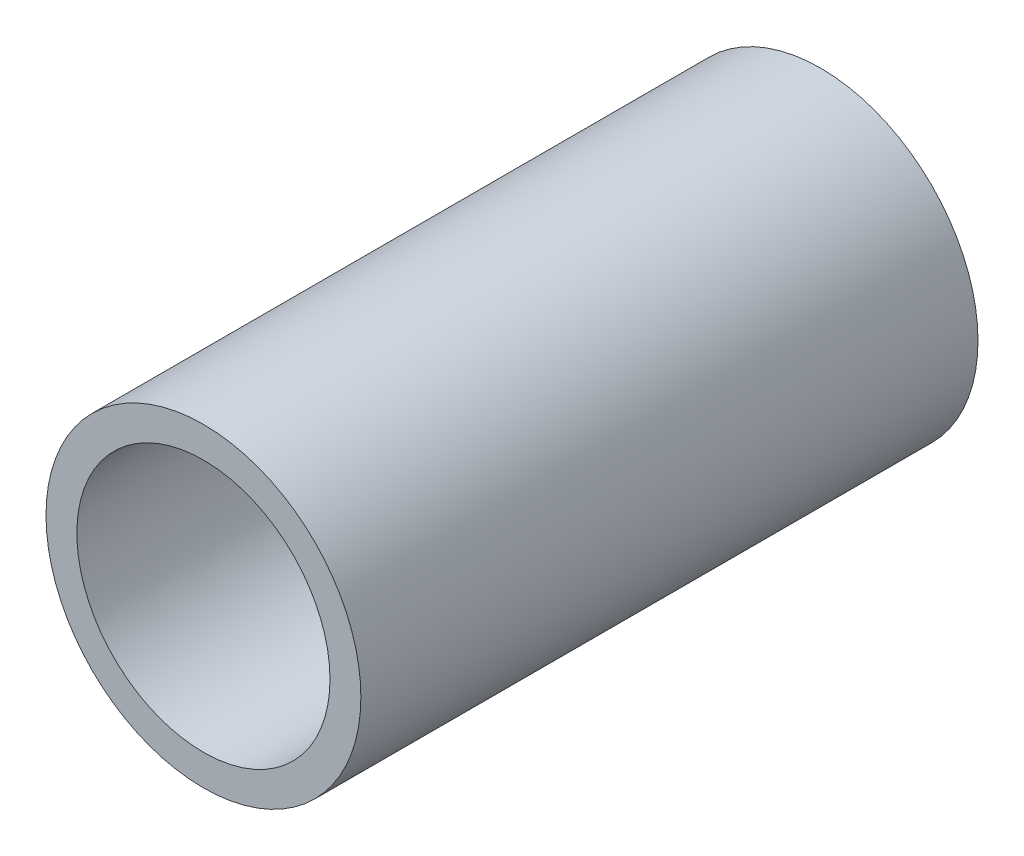
ISO-10303-21;
HEADER;
FILE_DESCRIPTION(('STEP AP214'),'2;1');
FILE_NAME('part.step','',(''),(''),'','','');
FILE_SCHEMA(('AUTOMOTIVE_DESIGN { 1 0 10303 214 1 1 1 1 }'));
ENDSEC;
DATA;
#1=APPLICATION_CONTEXT('core data for automotive mechanical design processes');
#2=APPLICATION_PROTOCOL_DEFINITION('international standard','automotive_design',2000,#1);
#3=PRODUCT_CONTEXT('',#1,'mechanical');
#4=PRODUCT('Part','Part','',(#3));
#5=PRODUCT_RELATED_PRODUCT_CATEGORY('part','',(#4));
#6=PRODUCT_DEFINITION_FORMATION('','',#4);
#7=PRODUCT_DEFINITION_CONTEXT('part definition',#1,'design');
#8=PRODUCT_DEFINITION('design','',#6,#7);
#9=PRODUCT_DEFINITION_SHAPE('','',#8);
#10=(LENGTH_UNIT() NAMED_UNIT(*) SI_UNIT(.MILLI.,.METRE.));
#11=(NAMED_UNIT(*) PLANE_ANGLE_UNIT() SI_UNIT($,.RADIAN.));
#12=(NAMED_UNIT(*) SI_UNIT($,.STERADIAN.) SOLID_ANGLE_UNIT());
#13=UNCERTAINTY_MEASURE_WITH_UNIT(LENGTH_MEASURE(1.E-05),#10,'distance_accuracy_value','');
#14=(GEOMETRIC_REPRESENTATION_CONTEXT(3) GLOBAL_UNCERTAINTY_ASSIGNED_CONTEXT((#13)) GLOBAL_UNIT_ASSIGNED_CONTEXT((#10,
#11,#12)) REPRESENTATION_CONTEXT('',''));
#15=CARTESIAN_POINT('',(0.,0.,0.));
#16=DIRECTION('',(0.,0.,1.));
#17=DIRECTION('',(1.,0.,0.));
#18=AXIS2_PLACEMENT_3D('',#15,#16,#17);
#19=CARTESIAN_POINT('',(0.,0.,12.446));
#20=DIRECTION('',(0.,0.,1.));
#21=DIRECTION('',(1.,0.,0.));
#22=AXIS2_PLACEMENT_3D('',#19,#20,#21);
#23=PLANE('',#22);
#24=CARTESIAN_POINT('',(0.,0.,12.446));
#25=DIRECTION('',(0.,0.,1.));
#26=DIRECTION('',(1.,0.,0.));
#27=AXIS2_PLACEMENT_3D('',#24,#25,#26);
#28=CIRCLE('',#27,6.35);
#29=CARTESIAN_POINT('',(6.35,0.,12.446));
#30=VERTEX_POINT('',#29);
#31=EDGE_CURVE('E10',#30,#30,#28,.T.);
#32=ORIENTED_EDGE('',*,*,#31,.T.);
#33=EDGE_LOOP('',(#32));
#34=FACE_BOUND('',#33,.T.);
#35=CARTESIAN_POINT('',(0.,0.,12.446));
#36=DIRECTION('',(0.,0.,1.));
#37=DIRECTION('',(1.,0.,0.));
#38=AXIS2_PLACEMENT_3D('',#35,#36,#37);
#39=CIRCLE('',#38,5.1054);
#40=CARTESIAN_POINT('',(5.1054,0.,12.446));
#41=VERTEX_POINT('',#40);
#42=EDGE_CURVE('E42',#41,#41,#39,.T.);
#43=ORIENTED_EDGE('',*,*,#42,.F.);
#44=EDGE_LOOP('',(#43));
#45=FACE_BOUND('',#44,.T.);
#46=ADVANCED_FACE('F35',(#34,#45),#23,.T.);
#47=CARTESIAN_POINT('',(0.,0.,12.446));
#48=DIRECTION('',(0.,0.,-1.));
#49=DIRECTION('',(-1.,0.,0.));
#50=AXIS2_PLACEMENT_3D('',#47,#48,#49);
#51=CYLINDRICAL_SURFACE('',#50,6.35);
#52=ORIENTED_EDGE('',*,*,#31,.F.);
#53=EDGE_LOOP('',(#52));
#54=FACE_BOUND('',#53,.T.);
#55=CARTESIAN_POINT('',(0.,0.,-12.446));
#56=DIRECTION('',(0.,0.,1.));
#57=DIRECTION('',(1.,0.,0.));
#58=AXIS2_PLACEMENT_3D('',#55,#56,#57);
#59=CIRCLE('',#58,6.35);
#60=CARTESIAN_POINT('',(6.35,0.,-12.446));
#61=VERTEX_POINT('',#60);
#62=EDGE_CURVE('E46',#61,#61,#59,.T.);
#63=ORIENTED_EDGE('',*,*,#62,.T.);
#64=EDGE_LOOP('',(#63));
#65=FACE_BOUND('',#64,.T.);
#66=ADVANCED_FACE('F37',(#54,#65),#51,.T.);
#67=CARTESIAN_POINT('',(0.,0.,12.446));
#68=DIRECTION('',(0.,0.,-1.));
#69=DIRECTION('',(-1.,0.,0.));
#70=AXIS2_PLACEMENT_3D('',#67,#68,#69);
#71=CYLINDRICAL_SURFACE('',#70,5.1054);
#72=ORIENTED_EDGE('',*,*,#42,.T.);
#73=EDGE_LOOP('',(#72));
#74=FACE_BOUND('',#73,.T.);
#75=CARTESIAN_POINT('',(0.,0.,-12.446));
#76=DIRECTION('',(0.,0.,1.));
#77=DIRECTION('',(1.,0.,0.));
#78=AXIS2_PLACEMENT_3D('',#75,#76,#77);
#79=CIRCLE('',#78,5.1054);
#80=CARTESIAN_POINT('',(5.1054,0.,-12.446));
#81=VERTEX_POINT('',#80);
#82=EDGE_CURVE('E50',#81,#81,#79,.T.);
#83=ORIENTED_EDGE('',*,*,#82,.F.);
#84=EDGE_LOOP('',(#83));
#85=FACE_BOUND('',#84,.T.);
#86=ADVANCED_FACE('F59',(#74,#85),#71,.F.);
#87=CARTESIAN_POINT('',(0.,0.,-12.446));
#88=DIRECTION('',(0.,0.,1.));
#89=DIRECTION('',(1.,0.,0.));
#90=AXIS2_PLACEMENT_3D('',#87,#88,#89);
#91=PLANE('',#90);
#92=ORIENTED_EDGE('',*,*,#82,.T.);
#93=EDGE_LOOP('',(#92));
#94=FACE_BOUND('',#93,.T.);
#95=ORIENTED_EDGE('',*,*,#62,.F.);
#96=EDGE_LOOP('',(#95));
#97=FACE_BOUND('',#96,.T.);
#98=ADVANCED_FACE('F56',(#94,#97),#91,.F.);
#99=CLOSED_SHELL('',(#46,#66,#86,#98));
#100=MANIFOLD_SOLID_BREP('B2',#99);
#101=ADVANCED_BREP_SHAPE_REPRESENTATION('',(#18,#100),#14);
#102=SHAPE_DEFINITION_REPRESENTATION(#9,#101);
ENDSEC;
END-ISO-10303-21;
